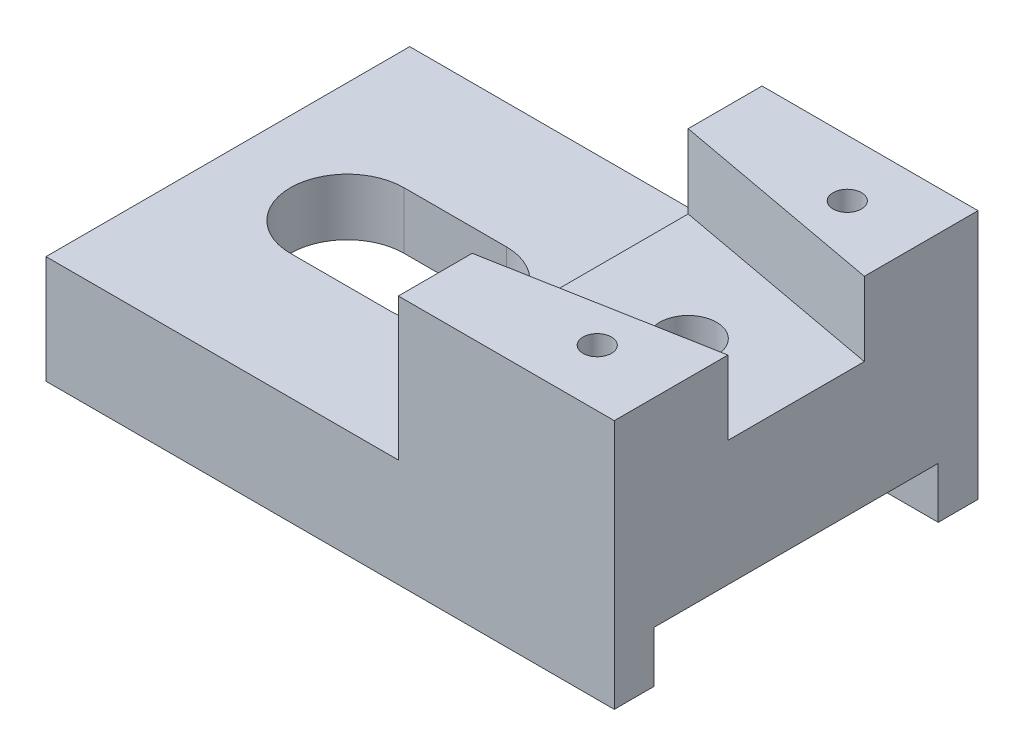
ISO-10303-21;
HEADER;
FILE_DESCRIPTION(('STEP AP214'),'2;1');
FILE_NAME('part.step','',(''),(''),'','','');
FILE_SCHEMA(('AUTOMOTIVE_DESIGN { 1 0 10303 214 1 1 1 1 }'));
ENDSEC;
DATA;
#1=APPLICATION_CONTEXT('core data for automotive mechanical design processes');
#2=APPLICATION_PROTOCOL_DEFINITION('international standard','automotive_design',2000,#1);
#3=PRODUCT_CONTEXT('',#1,'mechanical');
#4=PRODUCT('Part','Part','',(#3));
#5=PRODUCT_RELATED_PRODUCT_CATEGORY('part','',(#4));
#6=PRODUCT_DEFINITION_FORMATION('','',#4);
#7=PRODUCT_DEFINITION_CONTEXT('part definition',#1,'design');
#8=PRODUCT_DEFINITION('design','',#6,#7);
#9=PRODUCT_DEFINITION_SHAPE('','',#8);
#10=(LENGTH_UNIT() NAMED_UNIT(*) SI_UNIT(.MILLI.,.METRE.));
#11=(NAMED_UNIT(*) PLANE_ANGLE_UNIT() SI_UNIT($,.RADIAN.));
#12=(NAMED_UNIT(*) SI_UNIT($,.STERADIAN.) SOLID_ANGLE_UNIT());
#13=UNCERTAINTY_MEASURE_WITH_UNIT(LENGTH_MEASURE(1.E-05),#10,'distance_accuracy_value','');
#14=(GEOMETRIC_REPRESENTATION_CONTEXT(3) GLOBAL_UNCERTAINTY_ASSIGNED_CONTEXT((#13)) GLOBAL_UNIT_ASSIGNED_CONTEXT((#10,
#11,#12)) REPRESENTATION_CONTEXT('',''));
#15=CARTESIAN_POINT('',(0.,0.,0.));
#16=DIRECTION('',(0.,0.,1.));
#17=DIRECTION('',(1.,0.,0.));
#18=AXIS2_PLACEMENT_3D('',#15,#16,#17);
#19=CARTESIAN_POINT('',(0.,-24.1014799154334,-64.));
#20=DIRECTION('',(0.,-1.,0.));
#21=DIRECTION('',(0.,0.,-1.));
#22=AXIS2_PLACEMENT_3D('',#19,#20,#21);
#23=PLANE('',#22);
#24=DIRECTION('',(-1.,0.,0.));
#25=VECTOR('',#24,1.);
#26=CARTESIAN_POINT('',(55.3911205073996,-24.1014799154334,-7.));
#27=LINE('',#26,#25);
#28=CARTESIAN_POINT('',(55.3911205073996,-24.1014799154334,-7.));
#29=VERTEX_POINT('',#28);
#30=CARTESIAN_POINT('',(-44.6088794926004,-24.1014799154334,-7.));
#31=VERTEX_POINT('',#30);
#32=EDGE_CURVE('E231',#29,#31,#27,.T.);
#33=ORIENTED_EDGE('',*,*,#32,.F.);
#34=DIRECTION('',(0.,0.,1.));
#35=VECTOR('',#34,1.);
#36=CARTESIAN_POINT('',(55.3911205073996,-24.1014799154334,-64.));
#37=LINE('',#36,#35);
#38=CARTESIAN_POINT('',(55.3911205073996,-24.1014799154334,0.));
#39=VERTEX_POINT('',#38);
#40=EDGE_CURVE('E334',#29,#39,#37,.T.);
#41=ORIENTED_EDGE('',*,*,#40,.T.);
#42=DIRECTION('',(1.,0.,0.));
#43=VECTOR('',#42,1.);
#44=CARTESIAN_POINT('',(0.,-24.1014799154334,0.));
#45=LINE('',#44,#43);
#46=CARTESIAN_POINT('',(-44.6088794926004,-24.1014799154334,0.));
#47=VERTEX_POINT('',#46);
#48=EDGE_CURVE('E301',#47,#39,#45,.T.);
#49=ORIENTED_EDGE('',*,*,#48,.F.);
#50=DIRECTION('',(0.,0.,1.));
#51=VECTOR('',#50,1.);
#52=CARTESIAN_POINT('',(-44.6088794926004,-24.1014799154334,-64.));
#53=LINE('',#52,#51);
#54=EDGE_CURVE('E358',#31,#47,#53,.T.);
#55=ORIENTED_EDGE('',*,*,#54,.F.);
#56=EDGE_LOOP('',(#33,#41,#49,#55));
#57=FACE_BOUND('',#56,.T.);
#58=ADVANCED_FACE('F48',(#57),#23,.T.);
#59=CARTESIAN_POINT('',(0.,19.8985200845666,-64.));
#60=DIRECTION('',(0.,1.,0.));
#61=DIRECTION('',(-1.,0.,0.));
#62=AXIS2_PLACEMENT_3D('',#59,#60,#61);
#63=PLANE('',#62);
#64=CARTESIAN_POINT('',(42.3911205073996,19.8985200845666,-9.99999999999999));
#65=DIRECTION('',(0.,1.,0.));
#66=DIRECTION('',(0.,0.,1.));
#67=AXIS2_PLACEMENT_3D('',#64,#65,#66);
#68=CIRCLE('',#67,2.5);
#69=CARTESIAN_POINT('',(42.3911205073996,19.8985200845666,-7.5));
#70=VERTEX_POINT('',#69);
#71=EDGE_CURVE('E190',#70,#70,#68,.T.);
#72=ORIENTED_EDGE('',*,*,#71,.F.);
#73=EDGE_LOOP('',(#72));
#74=FACE_BOUND('',#73,.T.);
#75=DIRECTION('',(0.983453188589073,0.,-0.181162429476934));
#76=VECTOR('',#75,1.);
#77=CARTESIAN_POINT('',(17.3911205073996,19.8985200845666,-13.));
#78=LINE('',#77,#76);
#79=CARTESIAN_POINT('',(17.3911205073996,19.8985200845666,-13.));
#80=VERTEX_POINT('',#79);
#81=CARTESIAN_POINT('',(55.3911205073996,19.8985200845666,-20.));
#82=VERTEX_POINT('',#81);
#83=EDGE_CURVE('E268',#80,#82,#78,.T.);
#84=ORIENTED_EDGE('',*,*,#83,.F.);
#85=DIRECTION('',(0.,0.,1.));
#86=VECTOR('',#85,1.);
#87=CARTESIAN_POINT('',(17.3911205073996,19.8985200845666,-64.));
#88=LINE('',#87,#86);
#89=CARTESIAN_POINT('',(17.3911205073996,19.8985200845666,0.));
#90=VERTEX_POINT('',#89);
#91=EDGE_CURVE('E371',#80,#90,#88,.T.);
#92=ORIENTED_EDGE('',*,*,#91,.T.);
#93=DIRECTION('',(-1.,0.,0.));
#94=VECTOR('',#93,1.);
#95=CARTESIAN_POINT('',(0.,19.8985200845666,0.));
#96=LINE('',#95,#94);
#97=CARTESIAN_POINT('',(55.3911205073996,19.8985200845666,0.));
#98=VERTEX_POINT('',#97);
#99=EDGE_CURVE('E342',#98,#90,#96,.T.);
#100=ORIENTED_EDGE('',*,*,#99,.F.);
#101=DIRECTION('',(0.,0.,1.));
#102=VECTOR('',#101,1.);
#103=CARTESIAN_POINT('',(55.3911205073996,19.8985200845666,-64.));
#104=LINE('',#103,#102);
#105=EDGE_CURVE('E376',#82,#98,#104,.T.);
#106=ORIENTED_EDGE('',*,*,#105,.F.);
#107=EDGE_LOOP('',(#84,#92,#100,#106));
#108=FACE_BOUND('',#107,.T.);
#109=ADVANCED_FACE('F417',(#74,#108),#63,.T.);
#110=DIRECTION('',(-1.,0.,0.));
#111=VECTOR('',#110,1.);
#112=CARTESIAN_POINT('',(55.3911205073996,-24.1014799154334,-57.));
#113=LINE('',#112,#111);
#114=CARTESIAN_POINT('',(55.3911205073996,-24.1014799154334,-57.));
#115=VERTEX_POINT('',#114);
#116=CARTESIAN_POINT('',(-44.6088794926004,-24.1014799154334,-57.));
#117=VERTEX_POINT('',#116);
#118=EDGE_CURVE('E65',#115,#117,#113,.T.);
#119=ORIENTED_EDGE('',*,*,#118,.T.);
#120=CARTESIAN_POINT('',(-44.6088794926004,-24.1014799154334,-64.));
#121=VERTEX_POINT('',#120);
#122=EDGE_CURVE('E58',#121,#117,#53,.T.);
#123=ORIENTED_EDGE('',*,*,#122,.F.);
#124=DIRECTION('',(1.,0.,0.));
#125=VECTOR('',#124,1.);
#126=CARTESIAN_POINT('',(0.,-24.1014799154334,-64.));
#127=LINE('',#126,#125);
#128=CARTESIAN_POINT('',(55.3911205073996,-24.1014799154334,-64.));
#129=VERTEX_POINT('',#128);
#130=EDGE_CURVE('E312',#121,#129,#127,.T.);
#131=ORIENTED_EDGE('',*,*,#130,.T.);
#132=EDGE_CURVE('E377',#129,#115,#37,.T.);
#133=ORIENTED_EDGE('',*,*,#132,.T.);
#134=EDGE_LOOP('',(#119,#123,#131,#133));
#135=FACE_BOUND('',#134,.T.);
#136=ADVANCED_FACE('F50',(#135),#23,.T.);
#137=CARTESIAN_POINT('',(-44.6088794926004,0.,-64.));
#138=DIRECTION('',(1.,0.,0.));
#139=DIRECTION('',(0.,0.,-1.));
#140=AXIS2_PLACEMENT_3D('',#137,#138,#139);
#141=PLANE('',#140);
#142=DIRECTION('',(0.,0.,-1.));
#143=VECTOR('',#142,1.);
#144=CARTESIAN_POINT('',(-44.6088794926004,-15.1014799154334,-14.0437777179026));
#145=LINE('',#144,#143);
#146=CARTESIAN_POINT('',(-44.6088794926004,-15.1014799154334,-7.));
#147=VERTEX_POINT('',#146);
#148=CARTESIAN_POINT('',(-44.6088794926004,-15.1014799154334,-57.));
#149=VERTEX_POINT('',#148);
#150=EDGE_CURVE('E211',#147,#149,#145,.T.);
#151=ORIENTED_EDGE('',*,*,#150,.F.);
#152=DIRECTION('',(0.,1.,0.));
#153=VECTOR('',#152,1.);
#154=CARTESIAN_POINT('',(-44.6088794926004,-24.1014799154334,-7.));
#155=LINE('',#154,#153);
#156=EDGE_CURVE('E221',#31,#147,#155,.T.);
#157=ORIENTED_EDGE('',*,*,#156,.F.);
#158=ORIENTED_EDGE('',*,*,#54,.T.);
#159=DIRECTION('',(0.,1.,0.));
#160=VECTOR('',#159,1.);
#161=CARTESIAN_POINT('',(-44.6088794926004,0.,0.));
#162=LINE('',#161,#160);
#163=CARTESIAN_POINT('',(-44.6088794926004,-5.1014799154334,0.));
#164=VERTEX_POINT('',#163);
#165=EDGE_CURVE('E317',#47,#164,#162,.T.);
#166=ORIENTED_EDGE('',*,*,#165,.T.);
#167=DIRECTION('',(0.,0.,1.));
#168=VECTOR('',#167,1.);
#169=CARTESIAN_POINT('',(-44.6088794926004,-5.1014799154334,-64.));
#170=LINE('',#169,#168);
#171=CARTESIAN_POINT('',(-44.6088794926004,-5.1014799154334,-64.));
#172=VERTEX_POINT('',#171);
#173=EDGE_CURVE('E359',#172,#164,#170,.T.);
#174=ORIENTED_EDGE('',*,*,#173,.F.);
#175=DIRECTION('',(0.,1.,0.));
#176=VECTOR('',#175,1.);
#177=CARTESIAN_POINT('',(-44.6088794926004,0.,-64.));
#178=LINE('',#177,#176);
#179=EDGE_CURVE('E331',#121,#172,#178,.T.);
#180=ORIENTED_EDGE('',*,*,#179,.F.);
#181=ORIENTED_EDGE('',*,*,#122,.T.);
#182=DIRECTION('',(0.,-1.,0.));
#183=VECTOR('',#182,1.);
#184=CARTESIAN_POINT('',(-44.6088794926004,-24.1014799154334,-57.));
#185=LINE('',#184,#183);
#186=EDGE_CURVE('E205',#149,#117,#185,.T.);
#187=ORIENTED_EDGE('',*,*,#186,.F.);
#188=EDGE_LOOP('',(#151,#157,#158,#166,#174,#180,#181,#187));
#189=FACE_BOUND('',#188,.T.);
#190=ADVANCED_FACE('F401',(#189),#141,.F.);
#191=CARTESIAN_POINT('',(0.,-5.1014799154334,-64.));
#192=DIRECTION('',(0.,-1.,0.));
#193=DIRECTION('',(0.,0.,-1.));
#194=AXIS2_PLACEMENT_3D('',#191,#192,#193);
#195=PLANE('',#194);
#196=DIRECTION('',(-1.,0.,0.));
#197=VECTOR('',#196,1.);
#198=CARTESIAN_POINT('',(-23.6088794926004,-5.1014799154334,-42.));
#199=LINE('',#198,#197);
#200=CARTESIAN_POINT('',(-5.60887949260043,-5.1014799154334,-42.));
#201=VERTEX_POINT('',#200);
#202=CARTESIAN_POINT('',(-23.6088794926004,-5.1014799154334,-42.));
#203=VERTEX_POINT('',#202);
#204=EDGE_CURVE('E252',#201,#203,#199,.T.);
#205=ORIENTED_EDGE('',*,*,#204,.F.);
#206=CARTESIAN_POINT('',(-5.60887949260043,-5.1014799154334,-32.));
#207=DIRECTION('',(0.,1.,0.));
#208=DIRECTION('',(0.,0.,-1.));
#209=AXIS2_PLACEMENT_3D('',#206,#207,#208);
#210=CIRCLE('',#209,10.);
#211=CARTESIAN_POINT('',(-5.60887949260043,-5.1014799154334,-22.));
#212=VERTEX_POINT('',#211);
#213=EDGE_CURVE('E248',#212,#201,#210,.T.);
#214=ORIENTED_EDGE('',*,*,#213,.F.);
#215=DIRECTION('',(1.,0.,0.));
#216=VECTOR('',#215,1.);
#217=CARTESIAN_POINT('',(-23.6088794926004,-5.1014799154334,-22.));
#218=LINE('',#217,#216);
#219=CARTESIAN_POINT('',(-23.6088794926004,-5.1014799154334,-22.));
#220=VERTEX_POINT('',#219);
#221=EDGE_CURVE('E260',#220,#212,#218,.T.);
#222=ORIENTED_EDGE('',*,*,#221,.F.);
#223=CARTESIAN_POINT('',(-23.6088794926004,-5.1014799154334,-32.));
#224=DIRECTION('',(0.,1.,0.));
#225=DIRECTION('',(0.,0.,1.));
#226=AXIS2_PLACEMENT_3D('',#223,#224,#225);
#227=CIRCLE('',#226,10.);
#228=EDGE_CURVE('E256',#203,#220,#227,.T.);
#229=ORIENTED_EDGE('',*,*,#228,.F.);
#230=EDGE_LOOP('',(#205,#214,#222,#229));
#231=FACE_BOUND('',#230,.T.);
#232=DIRECTION('',(1.,0.,0.));
#233=VECTOR('',#232,1.);
#234=CARTESIAN_POINT('',(0.,-5.1014799154334,0.));
#235=LINE('',#234,#233);
#236=CARTESIAN_POINT('',(17.3911205073996,-5.1014799154334,0.));
#237=VERTEX_POINT('',#236);
#238=EDGE_CURVE('E350',#164,#237,#235,.T.);
#239=ORIENTED_EDGE('',*,*,#238,.T.);
#240=DIRECTION('',(0.,0.,1.));
#241=VECTOR('',#240,1.);
#242=CARTESIAN_POINT('',(17.3911205073996,-5.1014799154334,-64.));
#243=LINE('',#242,#241);
#244=CARTESIAN_POINT('',(17.3911205073996,-5.1014799154334,-64.));
#245=VERTEX_POINT('',#244);
#246=EDGE_CURVE('E363',#245,#237,#243,.T.);
#247=ORIENTED_EDGE('',*,*,#246,.F.);
#248=DIRECTION('',(1.,0.,0.));
#249=VECTOR('',#248,1.);
#250=CARTESIAN_POINT('',(0.,-5.1014799154334,-64.));
#251=LINE('',#250,#249);
#252=EDGE_CURVE('E328',#172,#245,#251,.T.);
#253=ORIENTED_EDGE('',*,*,#252,.F.);
#254=ORIENTED_EDGE('',*,*,#173,.T.);
#255=EDGE_LOOP('',(#239,#247,#253,#254));
#256=FACE_BOUND('',#255,.T.);
#257=ADVANCED_FACE('F406',(#231,#256),#195,.F.);
#258=CARTESIAN_POINT('',(17.3911205073996,0.,-64.));
#259=DIRECTION('',(1.,0.,0.));
#260=DIRECTION('',(0.,0.,-1.));
#261=AXIS2_PLACEMENT_3D('',#258,#259,#260);
#262=PLANE('',#261);
#263=ORIENTED_EDGE('',*,*,#91,.F.);
#264=DIRECTION('',(0.,1.,0.));
#265=VECTOR('',#264,1.);
#266=CARTESIAN_POINT('',(17.3911205073996,6.8985200845666,-13.));
#267=LINE('',#266,#265);
#268=CARTESIAN_POINT('',(17.3911205073996,6.8985200845666,-13.));
#269=VERTEX_POINT('',#268);
#270=EDGE_CURVE('E298',#269,#80,#267,.T.);
#271=ORIENTED_EDGE('',*,*,#270,.F.);
#272=DIRECTION('',(0.,0.,1.));
#273=VECTOR('',#272,1.);
#274=CARTESIAN_POINT('',(17.3911205073996,6.8985200845666,-51.));
#275=LINE('',#274,#273);
#276=CARTESIAN_POINT('',(17.3911205073996,6.8985200845666,-51.));
#277=VERTEX_POINT('',#276);
#278=EDGE_CURVE('E289',#277,#269,#275,.T.);
#279=ORIENTED_EDGE('',*,*,#278,.F.);
#280=DIRECTION('',(0.,1.,0.));
#281=VECTOR('',#280,1.);
#282=CARTESIAN_POINT('',(17.3911205073996,6.8985200845666,-51.));
#283=LINE('',#282,#281);
#284=CARTESIAN_POINT('',(17.3911205073996,19.8985200845666,-51.));
#285=VERTEX_POINT('',#284);
#286=EDGE_CURVE('E302',#277,#285,#283,.T.);
#287=ORIENTED_EDGE('',*,*,#286,.T.);
#288=CARTESIAN_POINT('',(17.3911205073996,19.8985200845666,-64.));
#289=VERTEX_POINT('',#288);
#290=EDGE_CURVE('E367',#289,#285,#88,.T.);
#291=ORIENTED_EDGE('',*,*,#290,.F.);
#292=DIRECTION('',(0.,1.,0.));
#293=VECTOR('',#292,1.);
#294=CARTESIAN_POINT('',(17.3911205073996,0.,-64.));
#295=LINE('',#294,#293);
#296=EDGE_CURVE('E325',#245,#289,#295,.T.);
#297=ORIENTED_EDGE('',*,*,#296,.F.);
#298=ORIENTED_EDGE('',*,*,#246,.T.);
#299=DIRECTION('',(0.,1.,0.));
#300=VECTOR('',#299,1.);
#301=CARTESIAN_POINT('',(17.3911205073996,0.,0.));
#302=LINE('',#301,#300);
#303=EDGE_CURVE('E346',#237,#90,#302,.T.);
#304=ORIENTED_EDGE('',*,*,#303,.T.);
#305=EDGE_LOOP('',(#263,#271,#279,#287,#291,#297,#298,#304));
#306=FACE_BOUND('',#305,.T.);
#307=ADVANCED_FACE('F438',(#306),#262,.F.);
#308=CARTESIAN_POINT('',(42.3911205073996,19.8985200845666,-54.));
#309=DIRECTION('',(0.,1.,0.));
#310=DIRECTION('',(0.,0.,1.));
#311=AXIS2_PLACEMENT_3D('',#308,#309,#310);
#312=CIRCLE('',#311,2.5);
#313=CARTESIAN_POINT('',(42.3911205073996,19.8985200845666,-51.5));
#314=VERTEX_POINT('',#313);
#315=EDGE_CURVE('E191',#314,#314,#312,.T.);
#316=ORIENTED_EDGE('',*,*,#315,.F.);
#317=EDGE_LOOP('',(#316));
#318=FACE_BOUND('',#317,.T.);
#319=DIRECTION('',(-0.983453188589073,0.,-0.181162429476935));
#320=VECTOR('',#319,1.);
#321=CARTESIAN_POINT('',(17.3911205073996,19.8985200845666,-51.));
#322=LINE('',#321,#320);
#323=CARTESIAN_POINT('',(55.3911205073996,19.8985200845666,-44.));
#324=VERTEX_POINT('',#323);
#325=EDGE_CURVE('E281',#324,#285,#322,.T.);
#326=ORIENTED_EDGE('',*,*,#325,.F.);
#327=CARTESIAN_POINT('',(55.3911205073996,19.8985200845666,-64.));
#328=VERTEX_POINT('',#327);
#329=EDGE_CURVE('E372',#328,#324,#104,.T.);
#330=ORIENTED_EDGE('',*,*,#329,.F.);
#331=DIRECTION('',(-1.,0.,0.));
#332=VECTOR('',#331,1.);
#333=CARTESIAN_POINT('',(0.,19.8985200845666,-64.));
#334=LINE('',#333,#332);
#335=EDGE_CURVE('E321',#328,#289,#334,.T.);
#336=ORIENTED_EDGE('',*,*,#335,.T.);
#337=ORIENTED_EDGE('',*,*,#290,.T.);
#338=EDGE_LOOP('',(#326,#330,#336,#337));
#339=FACE_BOUND('',#338,.T.);
#340=ADVANCED_FACE('F426',(#318,#339),#63,.T.);
#341=CARTESIAN_POINT('',(55.3911205073996,0.,-64.));
#342=DIRECTION('',(1.,0.,0.));
#343=DIRECTION('',(0.,0.,-1.));
#344=AXIS2_PLACEMENT_3D('',#341,#342,#343);
#345=PLANE('',#344);
#346=DIRECTION('',(0.,1.,0.));
#347=VECTOR('',#346,1.);
#348=CARTESIAN_POINT('',(55.3911205073996,-24.1014799154334,-7.));
#349=LINE('',#348,#347);
#350=CARTESIAN_POINT('',(55.3911205073996,-15.1014799154334,-7.));
#351=VERTEX_POINT('',#350);
#352=EDGE_CURVE('E214',#29,#351,#349,.T.);
#353=ORIENTED_EDGE('',*,*,#352,.T.);
#354=DIRECTION('',(0.,0.,-1.));
#355=VECTOR('',#354,1.);
#356=CARTESIAN_POINT('',(55.3911205073996,-15.1014799154334,-52.2876099285497));
#357=LINE('',#356,#355);
#358=CARTESIAN_POINT('',(55.3911205073996,-15.1014799154334,-57.));
#359=VERTEX_POINT('',#358);
#360=EDGE_CURVE('E206',#351,#359,#357,.T.);
#361=ORIENTED_EDGE('',*,*,#360,.T.);
#362=DIRECTION('',(0.,-1.,0.));
#363=VECTOR('',#362,1.);
#364=CARTESIAN_POINT('',(55.3911205073996,-24.1014799154334,-57.));
#365=LINE('',#364,#363);
#366=EDGE_CURVE('E210',#359,#115,#365,.T.);
#367=ORIENTED_EDGE('',*,*,#366,.T.);
#368=ORIENTED_EDGE('',*,*,#132,.F.);
#369=DIRECTION('',(0.,1.,0.));
#370=VECTOR('',#369,1.);
#371=CARTESIAN_POINT('',(55.3911205073996,0.,-64.));
#372=LINE('',#371,#370);
#373=EDGE_CURVE('E316',#129,#328,#372,.T.);
#374=ORIENTED_EDGE('',*,*,#373,.T.);
#375=ORIENTED_EDGE('',*,*,#329,.T.);
#376=DIRECTION('',(0.,1.,0.));
#377=VECTOR('',#376,1.);
#378=CARTESIAN_POINT('',(55.3911205073996,6.8985200845666,-44.));
#379=LINE('',#378,#377);
#380=CARTESIAN_POINT('',(55.3911205073996,6.8985200845666,-44.));
#381=VERTEX_POINT('',#380);
#382=EDGE_CURVE('E306',#381,#324,#379,.T.);
#383=ORIENTED_EDGE('',*,*,#382,.F.);
#384=DIRECTION('',(0.,0.,-1.));
#385=VECTOR('',#384,1.);
#386=CARTESIAN_POINT('',(55.3911205073996,6.8985200845666,-44.));
#387=LINE('',#386,#385);
#388=CARTESIAN_POINT('',(55.3911205073996,6.8985200845666,-20.));
#389=VERTEX_POINT('',#388);
#390=EDGE_CURVE('E280',#389,#381,#387,.T.);
#391=ORIENTED_EDGE('',*,*,#390,.F.);
#392=DIRECTION('',(0.,1.,0.));
#393=VECTOR('',#392,1.);
#394=CARTESIAN_POINT('',(55.3911205073996,6.8985200845666,-20.));
#395=LINE('',#394,#393);
#396=EDGE_CURVE('E293',#389,#82,#395,.T.);
#397=ORIENTED_EDGE('',*,*,#396,.T.);
#398=ORIENTED_EDGE('',*,*,#105,.T.);
#399=DIRECTION('',(0.,1.,0.));
#400=VECTOR('',#399,1.);
#401=CARTESIAN_POINT('',(55.3911205073996,0.,0.));
#402=LINE('',#401,#400);
#403=EDGE_CURVE('E338',#39,#98,#402,.T.);
#404=ORIENTED_EDGE('',*,*,#403,.F.);
#405=ORIENTED_EDGE('',*,*,#40,.F.);
#406=EDGE_LOOP('',(#353,#361,#367,#368,#374,#375,#383,#391,#397,#398,#404,#405));
#407=FACE_BOUND('',#406,.T.);
#408=ADVANCED_FACE('F390',(#407),#345,.T.);
#409=CARTESIAN_POINT('',(0.,0.,-64.));
#410=DIRECTION('',(0.,0.,1.));
#411=DIRECTION('',(1.,0.,0.));
#412=AXIS2_PLACEMENT_3D('',#409,#410,#411);
#413=PLANE('',#412);
#414=ORIENTED_EDGE('',*,*,#130,.F.);
#415=ORIENTED_EDGE('',*,*,#179,.T.);
#416=ORIENTED_EDGE('',*,*,#252,.T.);
#417=ORIENTED_EDGE('',*,*,#296,.T.);
#418=ORIENTED_EDGE('',*,*,#335,.F.);
#419=ORIENTED_EDGE('',*,*,#373,.F.);
#420=EDGE_LOOP('',(#414,#415,#416,#417,#418,#419));
#421=FACE_BOUND('',#420,.T.);
#422=ADVANCED_FACE('F411',(#421),#413,.F.);
#423=CARTESIAN_POINT('',(0.,0.,0.));
#424=DIRECTION('',(0.,0.,1.));
#425=DIRECTION('',(1.,0.,0.));
#426=AXIS2_PLACEMENT_3D('',#423,#424,#425);
#427=PLANE('',#426);
#428=ORIENTED_EDGE('',*,*,#48,.T.);
#429=ORIENTED_EDGE('',*,*,#403,.T.);
#430=ORIENTED_EDGE('',*,*,#99,.T.);
#431=ORIENTED_EDGE('',*,*,#303,.F.);
#432=ORIENTED_EDGE('',*,*,#238,.F.);
#433=ORIENTED_EDGE('',*,*,#165,.F.);
#434=EDGE_LOOP('',(#428,#429,#430,#431,#432,#433));
#435=FACE_BOUND('',#434,.T.);
#436=ADVANCED_FACE('F395',(#435),#427,.T.);
#437=CARTESIAN_POINT('',(17.3911205073996,6.8985200845666,-13.));
#438=DIRECTION('',(0.181162429476934,0.,0.983453188589073));
#439=DIRECTION('',(0.983453188589073,0.,-0.181162429476935));
#440=AXIS2_PLACEMENT_3D('',#437,#438,#439);
#441=PLANE('',#440);
#442=ORIENTED_EDGE('',*,*,#83,.T.);
#443=ORIENTED_EDGE('',*,*,#396,.F.);
#444=DIRECTION('',(0.983453188589073,0.,-0.181162429476934));
#445=VECTOR('',#444,1.);
#446=CARTESIAN_POINT('',(17.3911205073996,6.8985200845666,-13.));
#447=LINE('',#446,#445);
#448=EDGE_CURVE('E277',#269,#389,#447,.T.);
#449=ORIENTED_EDGE('',*,*,#448,.F.);
#450=ORIENTED_EDGE('',*,*,#270,.T.);
#451=EDGE_LOOP('',(#442,#443,#449,#450));
#452=FACE_BOUND('',#451,.T.);
#453=ADVANCED_FACE('F454',(#452),#441,.F.);
#454=CARTESIAN_POINT('',(17.3911205073996,6.8985200845666,-51.));
#455=DIRECTION('',(0.181162429476935,0.,-0.983453188589073));
#456=DIRECTION('',(-0.983453188589073,0.,-0.181162429476935));
#457=AXIS2_PLACEMENT_3D('',#454,#455,#456);
#458=PLANE('',#457);
#459=ORIENTED_EDGE('',*,*,#325,.T.);
#460=ORIENTED_EDGE('',*,*,#286,.F.);
#461=DIRECTION('',(-0.983453188589073,0.,-0.181162429476935));
#462=VECTOR('',#461,1.);
#463=CARTESIAN_POINT('',(17.3911205073996,6.8985200845666,-51.));
#464=LINE('',#463,#462);
#465=EDGE_CURVE('E285',#381,#277,#464,.T.);
#466=ORIENTED_EDGE('',*,*,#465,.F.);
#467=ORIENTED_EDGE('',*,*,#382,.T.);
#468=EDGE_LOOP('',(#459,#460,#466,#467));
#469=FACE_BOUND('',#468,.T.);
#470=ADVANCED_FACE('F448',(#469),#458,.F.);
#471=CARTESIAN_POINT('',(0.,6.89852008456659,0.));
#472=DIRECTION('',(0.,-1.,0.));
#473=DIRECTION('',(1.,0.,0.));
#474=AXIS2_PLACEMENT_3D('',#471,#472,#473);
#475=PLANE('',#474);
#476=CARTESIAN_POINT('',(36.3911205073996,6.89852008456659,-32.));
#477=DIRECTION('',(0.,1.,0.));
#478=DIRECTION('',(-1.,0.,0.));
#479=AXIS2_PLACEMENT_3D('',#476,#477,#478);
#480=CIRCLE('',#479,5.);
#481=CARTESIAN_POINT('',(31.3911205073996,6.89852008456659,-32.));
#482=VERTEX_POINT('',#481);
#483=EDGE_CURVE('E751',#482,#482,#480,.T.);
#484=ORIENTED_EDGE('',*,*,#483,.F.);
#485=EDGE_LOOP('',(#484));
#486=FACE_BOUND('',#485,.T.);
#487=ORIENTED_EDGE('',*,*,#448,.T.);
#488=ORIENTED_EDGE('',*,*,#390,.T.);
#489=ORIENTED_EDGE('',*,*,#465,.T.);
#490=ORIENTED_EDGE('',*,*,#278,.T.);
#491=EDGE_LOOP('',(#487,#488,#489,#490));
#492=FACE_BOUND('',#491,.T.);
#493=ADVANCED_FACE('F453',(#486,#492),#475,.F.);
#494=CARTESIAN_POINT('',(-5.60887949260043,-24.1014799154334,-32.));
#495=DIRECTION('',(0.,1.,0.));
#496=DIRECTION('',(0.,0.,1.));
#497=AXIS2_PLACEMENT_3D('',#494,#495,#496);
#498=CYLINDRICAL_SURFACE('',#497,10.);
#499=DIRECTION('',(0.,1.,0.));
#500=VECTOR('',#499,1.);
#501=CARTESIAN_POINT('',(-5.60887949260043,-24.1014799154334,-42.));
#502=LINE('',#501,#500);
#503=CARTESIAN_POINT('',(-5.60887949260043,-15.1014799154334,-42.));
#504=VERTEX_POINT('',#503);
#505=EDGE_CURVE('E264',#504,#201,#502,.T.);
#506=ORIENTED_EDGE('',*,*,#505,.F.);
#507=CARTESIAN_POINT('',(-5.60887949260043,-15.1014799154334,-32.));
#508=DIRECTION('',(0.,1.,0.));
#509=DIRECTION('',(0.,0.,1.));
#510=AXIS2_PLACEMENT_3D('',#507,#508,#509);
#511=CIRCLE('',#510,10.);
#512=CARTESIAN_POINT('',(-5.60887949260043,-15.1014799154334,-22.));
#513=VERTEX_POINT('',#512);
#514=EDGE_CURVE('E73',#504,#513,#511,.F.);
#515=ORIENTED_EDGE('',*,*,#514,.T.);
#516=DIRECTION('',(0.,1.,0.));
#517=VECTOR('',#516,1.);
#518=CARTESIAN_POINT('',(-5.60887949260043,-24.1014799154334,-22.));
#519=LINE('',#518,#517);
#520=EDGE_CURVE('E265',#513,#212,#519,.T.);
#521=ORIENTED_EDGE('',*,*,#520,.T.);
#522=ORIENTED_EDGE('',*,*,#213,.T.);
#523=EDGE_LOOP('',(#506,#515,#521,#522));
#524=FACE_BOUND('',#523,.T.);
#525=ADVANCED_FACE('F572',(#524),#498,.F.);
#526=CARTESIAN_POINT('',(-23.6088794926004,-24.1014799154334,-22.));
#527=DIRECTION('',(0.,0.,1.));
#528=DIRECTION('',(1.,0.,0.));
#529=AXIS2_PLACEMENT_3D('',#526,#527,#528);
#530=PLANE('',#529);
#531=ORIENTED_EDGE('',*,*,#520,.F.);
#532=DIRECTION('',(-1.,0.,0.));
#533=VECTOR('',#532,1.);
#534=CARTESIAN_POINT('',(-23.6088794926004,-15.1014799154334,-22.));
#535=LINE('',#534,#533);
#536=CARTESIAN_POINT('',(-23.6088794926004,-15.1014799154334,-22.));
#537=VERTEX_POINT('',#536);
#538=EDGE_CURVE('E242',#513,#537,#535,.T.);
#539=ORIENTED_EDGE('',*,*,#538,.T.);
#540=DIRECTION('',(0.,1.,0.));
#541=VECTOR('',#540,1.);
#542=CARTESIAN_POINT('',(-23.6088794926004,-24.1014799154334,-22.));
#543=LINE('',#542,#541);
#544=EDGE_CURVE('E269',#537,#220,#543,.T.);
#545=ORIENTED_EDGE('',*,*,#544,.T.);
#546=ORIENTED_EDGE('',*,*,#221,.T.);
#547=EDGE_LOOP('',(#531,#539,#545,#546));
#548=FACE_BOUND('',#547,.T.);
#549=ADVANCED_FACE('F653',(#548),#530,.F.);
#550=CARTESIAN_POINT('',(-23.6088794926004,-24.1014799154334,-32.));
#551=DIRECTION('',(0.,1.,0.));
#552=DIRECTION('',(0.,0.,1.));
#553=AXIS2_PLACEMENT_3D('',#550,#551,#552);
#554=CYLINDRICAL_SURFACE('',#553,10.);
#555=ORIENTED_EDGE('',*,*,#544,.F.);
#556=CARTESIAN_POINT('',(-23.6088794926004,-15.1014799154334,-32.));
#557=DIRECTION('',(0.,1.,0.));
#558=DIRECTION('',(0.,0.,1.));
#559=AXIS2_PLACEMENT_3D('',#556,#557,#558);
#560=CIRCLE('',#559,10.);
#561=CARTESIAN_POINT('',(-23.6088794926004,-15.1014799154334,-42.));
#562=VERTEX_POINT('',#561);
#563=EDGE_CURVE('E230',#537,#562,#560,.F.);
#564=ORIENTED_EDGE('',*,*,#563,.T.);
#565=DIRECTION('',(0.,1.,0.));
#566=VECTOR('',#565,1.);
#567=CARTESIAN_POINT('',(-23.6088794926004,-24.1014799154334,-42.));
#568=LINE('',#567,#566);
#569=EDGE_CURVE('E272',#562,#203,#568,.T.);
#570=ORIENTED_EDGE('',*,*,#569,.T.);
#571=ORIENTED_EDGE('',*,*,#228,.T.);
#572=EDGE_LOOP('',(#555,#564,#570,#571));
#573=FACE_BOUND('',#572,.T.);
#574=ADVANCED_FACE('F642',(#573),#554,.F.);
#575=CARTESIAN_POINT('',(-23.6088794926004,-24.1014799154334,-42.));
#576=DIRECTION('',(0.,0.,-1.));
#577=DIRECTION('',(-1.,0.,0.));
#578=AXIS2_PLACEMENT_3D('',#575,#576,#577);
#579=PLANE('',#578);
#580=ORIENTED_EDGE('',*,*,#569,.F.);
#581=DIRECTION('',(1.,0.,0.));
#582=VECTOR('',#581,1.);
#583=CARTESIAN_POINT('',(-23.6088794926004,-15.1014799154334,-42.));
#584=LINE('',#583,#582);
#585=EDGE_CURVE('E11',#562,#504,#584,.T.);
#586=ORIENTED_EDGE('',*,*,#585,.T.);
#587=ORIENTED_EDGE('',*,*,#505,.T.);
#588=ORIENTED_EDGE('',*,*,#204,.T.);
#589=EDGE_LOOP('',(#580,#586,#587,#588));
#590=FACE_BOUND('',#589,.T.);
#591=ADVANCED_FACE('F583',(#590),#579,.F.);
#592=CARTESIAN_POINT('',(55.3911205073996,-15.1014799154334,-14.0437777179026));
#593=DIRECTION('',(0.,1.,0.));
#594=DIRECTION('',(0.,0.,1.));
#595=AXIS2_PLACEMENT_3D('',#592,#593,#594);
#596=PLANE('',#595);
#597=CARTESIAN_POINT('',(36.3911205073996,-15.1014799154334,-32.));
#598=DIRECTION('',(0.,1.,0.));
#599=DIRECTION('',(0.,0.,1.));
#600=AXIS2_PLACEMENT_3D('',#597,#598,#599);
#601=CIRCLE('',#600,5.);
#602=CARTESIAN_POINT('',(36.3911205073996,-15.1014799154334,-27.));
#603=VERTEX_POINT('',#602);
#604=EDGE_CURVE('E52',#603,#603,#601,.T.);
#605=ORIENTED_EDGE('',*,*,#604,.T.);
#606=EDGE_LOOP('',(#605));
#607=FACE_BOUND('',#606,.T.);
#608=ORIENTED_EDGE('',*,*,#150,.T.);
#609=DIRECTION('',(-1.,0.,0.));
#610=VECTOR('',#609,1.);
#611=CARTESIAN_POINT('',(55.3911205073996,-15.1014799154334,-57.));
#612=LINE('',#611,#610);
#613=EDGE_CURVE('E218',#359,#149,#612,.T.);
#614=ORIENTED_EDGE('',*,*,#613,.F.);
#615=ORIENTED_EDGE('',*,*,#360,.F.);
#616=DIRECTION('',(-1.,0.,0.));
#617=VECTOR('',#616,1.);
#618=CARTESIAN_POINT('',(55.3911205073996,-15.1014799154334,-7.));
#619=LINE('',#618,#617);
#620=EDGE_CURVE('E227',#351,#147,#619,.T.);
#621=ORIENTED_EDGE('',*,*,#620,.T.);
#622=EDGE_LOOP('',(#608,#614,#615,#621));
#623=FACE_BOUND('',#622,.T.);
#624=ORIENTED_EDGE('',*,*,#585,.F.);
#625=ORIENTED_EDGE('',*,*,#563,.F.);
#626=ORIENTED_EDGE('',*,*,#538,.F.);
#627=ORIENTED_EDGE('',*,*,#514,.F.);
#628=EDGE_LOOP('',(#624,#625,#626,#627));
#629=FACE_BOUND('',#628,.T.);
#630=ADVANCED_FACE('F577',(#607,#623,#629),#596,.F.);
#631=CARTESIAN_POINT('',(55.3911205073996,-24.1014799154334,-7.));
#632=DIRECTION('',(0.,0.,1.));
#633=DIRECTION('',(1.,0.,0.));
#634=AXIS2_PLACEMENT_3D('',#631,#632,#633);
#635=PLANE('',#634);
#636=ORIENTED_EDGE('',*,*,#156,.T.);
#637=ORIENTED_EDGE('',*,*,#620,.F.);
#638=ORIENTED_EDGE('',*,*,#352,.F.);
#639=ORIENTED_EDGE('',*,*,#32,.T.);
#640=EDGE_LOOP('',(#636,#637,#638,#639));
#641=FACE_BOUND('',#640,.T.);
#642=ADVANCED_FACE('F582',(#641),#635,.F.);
#643=CARTESIAN_POINT('',(55.3911205073996,-24.1014799154334,-57.));
#644=DIRECTION('',(0.,0.,-1.));
#645=DIRECTION('',(-1.,0.,0.));
#646=AXIS2_PLACEMENT_3D('',#643,#644,#645);
#647=PLANE('',#646);
#648=ORIENTED_EDGE('',*,*,#186,.T.);
#649=ORIENTED_EDGE('',*,*,#118,.F.);
#650=ORIENTED_EDGE('',*,*,#366,.F.);
#651=ORIENTED_EDGE('',*,*,#613,.T.);
#652=EDGE_LOOP('',(#648,#649,#650,#651));
#653=FACE_BOUND('',#652,.T.);
#654=ADVANCED_FACE('F531',(#653),#647,.F.);
#655=CARTESIAN_POINT('',(42.3911205073996,-0.101479915433401,-9.99999999999999));
#656=DIRECTION('',(0.,1.,0.));
#657=DIRECTION('',(0.,0.,1.));
#658=AXIS2_PLACEMENT_3D('',#655,#656,#657);
#659=CONICAL_SURFACE('',#658,2.5,1.02974425867665);
#660=CARTESIAN_POINT('',(42.3911205073996,-1.6036314630023,-9.99999999999999));
#661=VERTEX_POINT('',#660);
#662=VERTEX_LOOP('',#661);
#663=FACE_BOUND('',#662,.T.);
#664=CARTESIAN_POINT('',(42.3911205073996,-0.101479915433401,-9.99999999999999));
#665=DIRECTION('',(0.,1.,0.));
#666=DIRECTION('',(0.,0.,1.));
#667=AXIS2_PLACEMENT_3D('',#664,#665,#666);
#668=CIRCLE('',#667,2.5);
#669=CARTESIAN_POINT('',(42.3911205073996,-0.101479915433401,-7.5));
#670=VERTEX_POINT('',#669);
#671=EDGE_CURVE('E196',#670,#670,#668,.T.);
#672=ORIENTED_EDGE('',*,*,#671,.T.);
#673=EDGE_LOOP('',(#672));
#674=FACE_BOUND('',#673,.T.);
#675=ADVANCED_FACE('F526',(#663,#674),#659,.F.);
#676=CARTESIAN_POINT('',(42.3911205073996,19.8985200845666,-9.99999999999999));
#677=DIRECTION('',(0.,1.,0.));
#678=DIRECTION('',(0.,0.,1.));
#679=AXIS2_PLACEMENT_3D('',#676,#677,#678);
#680=CYLINDRICAL_SURFACE('',#679,2.5);
#681=ORIENTED_EDGE('',*,*,#671,.F.);
#682=EDGE_LOOP('',(#681));
#683=FACE_BOUND('',#682,.T.);
#684=ORIENTED_EDGE('',*,*,#71,.T.);
#685=EDGE_LOOP('',(#684));
#686=FACE_BOUND('',#685,.T.);
#687=ADVANCED_FACE('F183',(#683,#686),#680,.F.);
#688=CARTESIAN_POINT('',(42.3911205073996,-0.101479915433401,-54.));
#689=DIRECTION('',(0.,1.,0.));
#690=DIRECTION('',(0.,0.,1.));
#691=AXIS2_PLACEMENT_3D('',#688,#689,#690);
#692=CONICAL_SURFACE('',#691,2.5,1.02974425867665);
#693=CARTESIAN_POINT('',(42.3911205073996,-1.6036314630023,-54.));
#694=VERTEX_POINT('',#693);
#695=VERTEX_LOOP('',#694);
#696=FACE_BOUND('',#695,.T.);
#697=CARTESIAN_POINT('',(42.3911205073996,-0.101479915433401,-54.));
#698=DIRECTION('',(0.,1.,0.));
#699=DIRECTION('',(0.,0.,1.));
#700=AXIS2_PLACEMENT_3D('',#697,#698,#699);
#701=CIRCLE('',#700,2.5);
#702=CARTESIAN_POINT('',(42.3911205073996,-0.101479915433401,-51.5));
#703=VERTEX_POINT('',#702);
#704=EDGE_CURVE('E187',#703,#703,#701,.T.);
#705=ORIENTED_EDGE('',*,*,#704,.T.);
#706=EDGE_LOOP('',(#705));
#707=FACE_BOUND('',#706,.T.);
#708=ADVANCED_FACE('F179',(#696,#707),#692,.F.);
#709=CARTESIAN_POINT('',(42.3911205073996,19.8985200845666,-54.));
#710=DIRECTION('',(0.,1.,0.));
#711=DIRECTION('',(0.,0.,1.));
#712=AXIS2_PLACEMENT_3D('',#709,#710,#711);
#713=CYLINDRICAL_SURFACE('',#712,2.5);
#714=ORIENTED_EDGE('',*,*,#704,.F.);
#715=EDGE_LOOP('',(#714));
#716=FACE_BOUND('',#715,.T.);
#717=ORIENTED_EDGE('',*,*,#315,.T.);
#718=EDGE_LOOP('',(#717));
#719=FACE_BOUND('',#718,.T.);
#720=ADVANCED_FACE('F182',(#716,#719),#713,.F.);
#721=CARTESIAN_POINT('',(36.3911205073996,-24.1014799154334,-32.));
#722=DIRECTION('',(0.,1.,0.));
#723=DIRECTION('',(-1.,0.,0.));
#724=AXIS2_PLACEMENT_3D('',#721,#722,#723);
#725=CYLINDRICAL_SURFACE('',#724,5.);
#726=ORIENTED_EDGE('',*,*,#483,.T.);
#727=EDGE_LOOP('',(#726));
#728=FACE_BOUND('',#727,.T.);
#729=ORIENTED_EDGE('',*,*,#604,.F.);
#730=EDGE_LOOP('',(#729));
#731=FACE_BOUND('',#730,.T.);
#732=ADVANCED_FACE('F562',(#728,#731),#725,.F.);
#733=CLOSED_SHELL('',(#58,#109,#136,#190,#257,#307,#340,#408,#422,#436,#453,#470,#493,#525,#549,
#574,#591,#630,#642,#654,#675,#687,#708,#720,#732));
#734=MANIFOLD_SOLID_BREP('B2',#733);
#735=ADVANCED_BREP_SHAPE_REPRESENTATION('',(#18,#734),#14);
#736=SHAPE_DEFINITION_REPRESENTATION(#9,#735);
ENDSEC;
END-ISO-10303-21;
